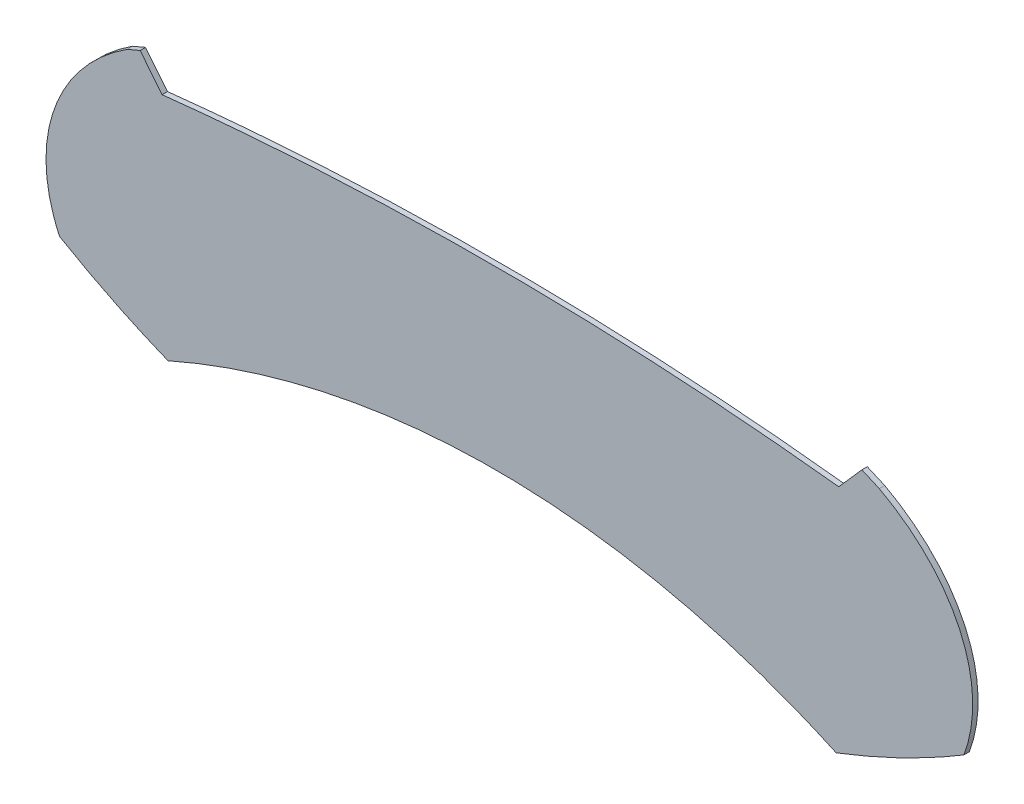
ISO-10303-21;
HEADER;
FILE_DESCRIPTION(('STEP AP214'),'2;1');
FILE_NAME('part.step','',(''),(''),'','','');
FILE_SCHEMA(('AUTOMOTIVE_DESIGN { 1 0 10303 214 1 1 1 1 }'));
ENDSEC;
DATA;
#1=APPLICATION_CONTEXT('core data for automotive mechanical design processes');
#2=APPLICATION_PROTOCOL_DEFINITION('international standard','automotive_design',2000,#1);
#3=PRODUCT_CONTEXT('',#1,'mechanical');
#4=PRODUCT('Part','Part','',(#3));
#5=PRODUCT_RELATED_PRODUCT_CATEGORY('part','',(#4));
#6=PRODUCT_DEFINITION_FORMATION('','',#4);
#7=PRODUCT_DEFINITION_CONTEXT('part definition',#1,'design');
#8=PRODUCT_DEFINITION('design','',#6,#7);
#9=PRODUCT_DEFINITION_SHAPE('','',#8);
#10=(LENGTH_UNIT() NAMED_UNIT(*) SI_UNIT(.MILLI.,.METRE.));
#11=(NAMED_UNIT(*) PLANE_ANGLE_UNIT() SI_UNIT($,.RADIAN.));
#12=(NAMED_UNIT(*) SI_UNIT($,.STERADIAN.) SOLID_ANGLE_UNIT());
#13=UNCERTAINTY_MEASURE_WITH_UNIT(LENGTH_MEASURE(1.E-05),#10,'distance_accuracy_value','');
#14=(GEOMETRIC_REPRESENTATION_CONTEXT(3) GLOBAL_UNCERTAINTY_ASSIGNED_CONTEXT((#13)) GLOBAL_UNIT_ASSIGNED_CONTEXT((#10,
#11,#12)) REPRESENTATION_CONTEXT('',''));
#15=CARTESIAN_POINT('',(0.,0.,0.));
#16=DIRECTION('',(0.,0.,1.));
#17=DIRECTION('',(1.,0.,0.));
#18=AXIS2_PLACEMENT_3D('',#15,#16,#17);
#19=CARTESIAN_POINT('',(67.0989134666407,30.7870693027646,0.1));
#20=CARTESIAN_POINT('',(60.8366785265383,31.4893738942949,0.1));
#21=CARTESIAN_POINT('',(54.5705838321318,30.8094593968933,0.1));
#22=(BOUNDED_CURVE() B_SPLINE_CURVE(2,(#19,#20,#21),.UNSPECIFIED.,.F.,
.F.) B_SPLINE_CURVE_WITH_KNOTS((3,3),(4.77600442953558,5.05009422888783),
.UNSPECIFIED.) CURVE() GEOMETRIC_REPRESENTATION_ITEM() RATIONAL_B_SPLINE_CURVE((1.,
0.990624035929916,1.)) REPRESENTATION_ITEM(''));
#23=DIRECTION('',(0.,0.,-1.));
#24=VECTOR('',#23,1.);
#25=SURFACE_OF_LINEAR_EXTRUSION('',#22,#24);
#26=CARTESIAN_POINT('',(67.0989134666407,30.7870693027646,0.));
#27=CARTESIAN_POINT('',(60.8366785265383,31.4893738942949,0.));
#28=CARTESIAN_POINT('',(54.5705838321318,30.8094593968933,0.));
#29=(BOUNDED_CURVE() B_SPLINE_CURVE(2,(#26,#27,#28),.UNSPECIFIED.,.F.,
.F.) B_SPLINE_CURVE_WITH_KNOTS((3,3),(4.77600442953558,5.05009422888783),
.UNSPECIFIED.) CURVE() GEOMETRIC_REPRESENTATION_ITEM() RATIONAL_B_SPLINE_CURVE((1.,
0.990624035929916,1.)) REPRESENTATION_ITEM(''));
#30=CARTESIAN_POINT('',(67.0989134666407,30.7870693027646,0.));
#31=VERTEX_POINT('',#30);
#32=CARTESIAN_POINT('',(54.5705838321318,30.8094593968933,0.));
#33=VERTEX_POINT('',#32);
#34=EDGE_CURVE('E268',#31,#33,#29,.T.);
#35=ORIENTED_EDGE('',*,*,#34,.T.);
#36=DIRECTION('',(0.,0.,-1.));
#37=VECTOR('',#36,1.);
#38=CARTESIAN_POINT('',(54.5705838321318,30.8094593968933,0.1));
#39=LINE('',#38,#37);
#40=CARTESIAN_POINT('',(54.5705838321318,30.8094593968933,0.1));
#41=VERTEX_POINT('',#40);
#42=EDGE_CURVE('E11',#41,#33,#39,.T.);
#43=ORIENTED_EDGE('',*,*,#42,.F.);
#44=CARTESIAN_POINT('',(67.0989134666407,30.7870693027646,0.1));
#45=VERTEX_POINT('',#44);
#46=EDGE_CURVE('E216',#45,#41,#22,.T.);
#47=ORIENTED_EDGE('',*,*,#46,.F.);
#48=DIRECTION('',(0.,0.,-1.));
#49=VECTOR('',#48,1.);
#50=CARTESIAN_POINT('',(67.0989134666407,30.7870693027646,0.1));
#51=LINE('',#50,#49);
#52=EDGE_CURVE('E138',#45,#31,#51,.T.);
#53=ORIENTED_EDGE('',*,*,#52,.T.);
#54=EDGE_LOOP('',(#35,#43,#47,#53));
#55=FACE_BOUND('',#54,.T.);
#56=ADVANCED_FACE('F33',(#55),#25,.F.);
#57=CARTESIAN_POINT('',(54.5705838321318,30.8094593968933,0.1));
#58=DIRECTION('',(-0.779683299889608,-0.62617405876741,0.));
#59=DIRECTION('',(0.62617405876741,-0.779683299889608,0.));
#60=AXIS2_PLACEMENT_3D('',#57,#58,#59);
#61=PLANE('',#60);
#62=CARTESIAN_POINT('',(54.5705838321318,30.8094593968933,0.));
#63=CARTESIAN_POINT('',(54.3675165126696,31.0623095357983,0.));
#64=CARTESIAN_POINT('',(54.1644491932074,31.3151596747032,0.));
#65=(BOUNDED_CURVE() B_SPLINE_CURVE(2,(#62,#63,#64),.UNSPECIFIED.,.F.,
.F.) B_SPLINE_CURVE_WITH_KNOTS((3,3),(5.05009422888783,6.05009422888783),
.UNSPECIFIED.) CURVE() GEOMETRIC_REPRESENTATION_ITEM() RATIONAL_B_SPLINE_CURVE((1.,1.,1.)) REPRESENTATION_ITEM(''));
#66=CARTESIAN_POINT('',(54.1644491932074,31.3151596747032,0.));
#67=VERTEX_POINT('',#66);
#68=EDGE_CURVE('E262',#33,#67,#65,.T.);
#69=ORIENTED_EDGE('',*,*,#68,.T.);
#70=DIRECTION('',(0.,0.,-1.));
#71=VECTOR('',#70,1.);
#72=CARTESIAN_POINT('',(54.1644491932074,31.3151596747032,0.1));
#73=LINE('',#72,#71);
#74=CARTESIAN_POINT('',(54.1644491932074,31.3151596747032,0.1));
#75=VERTEX_POINT('',#74);
#76=EDGE_CURVE('E42',#75,#67,#73,.T.);
#77=ORIENTED_EDGE('',*,*,#76,.F.);
#78=CARTESIAN_POINT('',(54.5705838321318,30.8094593968933,0.1));
#79=CARTESIAN_POINT('',(54.3675165126696,31.0623095357983,0.1));
#80=CARTESIAN_POINT('',(54.1644491932074,31.3151596747032,0.1));
#81=(BOUNDED_CURVE() B_SPLINE_CURVE(2,(#78,#79,#80),.UNSPECIFIED.,.F.,
.F.) B_SPLINE_CURVE_WITH_KNOTS((3,3),(5.05009422888783,6.05009422888783),
.UNSPECIFIED.) CURVE() GEOMETRIC_REPRESENTATION_ITEM() RATIONAL_B_SPLINE_CURVE((1.,1.,1.)) REPRESENTATION_ITEM(''));
#82=EDGE_CURVE('E99',#41,#75,#81,.T.);
#83=ORIENTED_EDGE('',*,*,#82,.F.);
#84=ORIENTED_EDGE('',*,*,#42,.T.);
#85=EDGE_LOOP('',(#69,#77,#83,#84));
#86=FACE_BOUND('',#85,.T.);
#87=ADVANCED_FACE('F204',(#86),#61,.F.);
#88=CARTESIAN_POINT('',(54.1644491932074,31.3151596747033,0.1));
#89=CARTESIAN_POINT('',(54.0438552768817,31.2653158805157,0.1));
#90=CARTESIAN_POINT('',(53.9244533851282,31.2136680771229,0.1));
#91=(BOUNDED_CURVE() B_SPLINE_CURVE(2,(#88,#89,#90),.UNSPECIFIED.,.F.,
.F.) B_SPLINE_CURVE_WITH_KNOTS((3,3),(0.,0.0187915377883803),
.UNSPECIFIED.) CURVE() GEOMETRIC_REPRESENTATION_ITEM() RATIONAL_B_SPLINE_CURVE((1.,
0.999955860088169,1.)) REPRESENTATION_ITEM(''));
#92=DIRECTION('',(0.,0.,-1.));
#93=VECTOR('',#92,1.);
#94=SURFACE_OF_LINEAR_EXTRUSION('',#91,#93);
#95=CARTESIAN_POINT('',(54.1644491932074,31.3151596747033,0.));
#96=CARTESIAN_POINT('',(54.0438552768817,31.2653158805157,0.));
#97=CARTESIAN_POINT('',(53.9244533851282,31.2136680771229,0.));
#98=(BOUNDED_CURVE() B_SPLINE_CURVE(2,(#95,#96,#97),.UNSPECIFIED.,.F.,
.F.) B_SPLINE_CURVE_WITH_KNOTS((3,3),(0.,0.0187915377883803),
.UNSPECIFIED.) CURVE() GEOMETRIC_REPRESENTATION_ITEM() RATIONAL_B_SPLINE_CURVE((1.,
0.999955860088169,1.)) REPRESENTATION_ITEM(''));
#99=CARTESIAN_POINT('',(53.9244533851282,31.2136680771229,0.));
#100=VERTEX_POINT('',#99);
#101=EDGE_CURVE('E257',#67,#100,#98,.T.);
#102=ORIENTED_EDGE('',*,*,#101,.T.);
#103=DIRECTION('',(0.,0.,-1.));
#104=VECTOR('',#103,1.);
#105=CARTESIAN_POINT('',(53.9244533851282,31.2136680771229,0.1));
#106=LINE('',#105,#104);
#107=CARTESIAN_POINT('',(53.9244533851282,31.2136680771229,0.1));
#108=VERTEX_POINT('',#107);
#109=EDGE_CURVE('E251',#108,#100,#106,.T.);
#110=ORIENTED_EDGE('',*,*,#109,.F.);
#111=EDGE_CURVE('E206',#75,#108,#91,.T.);
#112=ORIENTED_EDGE('',*,*,#111,.F.);
#113=ORIENTED_EDGE('',*,*,#76,.T.);
#114=EDGE_LOOP('',(#102,#110,#112,#113));
#115=FACE_BOUND('',#114,.T.);
#116=ADVANCED_FACE('F201',(#115),#94,.F.);
#117=CARTESIAN_POINT('',(53.9244533851282,31.2136680771229,0.1));
#118=CARTESIAN_POINT('',(51.6668754829006,29.7616501644239,0.1));
#119=CARTESIAN_POINT('',(52.6705171553145,27.5878177650123,0.1));
#120=(BOUNDED_CURVE() B_SPLINE_CURVE(2,(#117,#118,#119),.UNSPECIFIED.,.F.,
.F.) B_SPLINE_CURVE_WITH_KNOTS((3,3),(0.0187915377883803,1.26624299550098),
.UNSPECIFIED.) CURVE() GEOMETRIC_REPRESENTATION_ITEM() RATIONAL_B_SPLINE_CURVE((1.,
0.811708033467145,1.)) REPRESENTATION_ITEM(''));
#121=DIRECTION('',(0.,0.,-1.));
#122=VECTOR('',#121,1.);
#123=SURFACE_OF_LINEAR_EXTRUSION('',#120,#122);
#124=CARTESIAN_POINT('',(53.9244533851282,31.2136680771229,0.));
#125=CARTESIAN_POINT('',(51.6668754829006,29.7616501644239,0.));
#126=CARTESIAN_POINT('',(52.6705171553145,27.5878177650123,0.));
#127=(BOUNDED_CURVE() B_SPLINE_CURVE(2,(#124,#125,#126),.UNSPECIFIED.,.F.,
.F.) B_SPLINE_CURVE_WITH_KNOTS((3,3),(0.0187915377883803,1.26624299550098),
.UNSPECIFIED.) CURVE() GEOMETRIC_REPRESENTATION_ITEM() RATIONAL_B_SPLINE_CURVE((1.,
0.811708033467145,1.)) REPRESENTATION_ITEM(''));
#128=CARTESIAN_POINT('',(52.6705171553145,27.5878177650123,0.));
#129=VERTEX_POINT('',#128);
#130=EDGE_CURVE('E264',#100,#129,#127,.T.);
#131=ORIENTED_EDGE('',*,*,#130,.T.);
#132=DIRECTION('',(0.,0.,-1.));
#133=VECTOR('',#132,1.);
#134=CARTESIAN_POINT('',(52.6705171553145,27.5878177650123,0.1));
#135=LINE('',#134,#133);
#136=CARTESIAN_POINT('',(52.6705171553145,27.5878177650123,0.1));
#137=VERTEX_POINT('',#136);
#138=EDGE_CURVE('E248',#137,#129,#135,.T.);
#139=ORIENTED_EDGE('',*,*,#138,.F.);
#140=EDGE_CURVE('E186',#108,#137,#120,.T.);
#141=ORIENTED_EDGE('',*,*,#140,.F.);
#142=ORIENTED_EDGE('',*,*,#109,.T.);
#143=EDGE_LOOP('',(#131,#139,#141,#142));
#144=FACE_BOUND('',#143,.T.);
#145=ADVANCED_FACE('F197',(#144),#123,.F.);
#146=CARTESIAN_POINT('',(52.6705171553145,27.5878177650123,0.1));
#147=CARTESIAN_POINT('',(53.6230494195417,27.0250289886642,0.1));
#148=CARTESIAN_POINT('',(54.6801318608769,26.5981055296968,0.1));
#149=(BOUNDED_CURVE() B_SPLINE_CURVE(2,(#146,#147,#148),.UNSPECIFIED.,.F.,
.F.) B_SPLINE_CURVE_WITH_KNOTS((3,3),(1.26624299550098,1.43486145262142),
.UNSPECIFIED.) CURVE() GEOMETRIC_REPRESENTATION_ITEM() RATIONAL_B_SPLINE_CURVE((1.,
0.996448081670989,1.)) REPRESENTATION_ITEM(''));
#150=DIRECTION('',(0.,0.,-1.));
#151=VECTOR('',#150,1.);
#152=SURFACE_OF_LINEAR_EXTRUSION('',#149,#151);
#153=CARTESIAN_POINT('',(52.6705171553145,27.5878177650123,0.));
#154=CARTESIAN_POINT('',(53.6230494195417,27.0250289886642,0.));
#155=CARTESIAN_POINT('',(54.6801318608769,26.5981055296968,0.));
#156=(BOUNDED_CURVE() B_SPLINE_CURVE(2,(#153,#154,#155),.UNSPECIFIED.,.F.,
.F.) B_SPLINE_CURVE_WITH_KNOTS((3,3),(1.26624299550098,1.43486145262142),
.UNSPECIFIED.) CURVE() GEOMETRIC_REPRESENTATION_ITEM() RATIONAL_B_SPLINE_CURVE((1.,
0.996448081670989,1.)) REPRESENTATION_ITEM(''));
#157=CARTESIAN_POINT('',(54.6801318608769,26.5981055296968,0.));
#158=VERTEX_POINT('',#157);
#159=EDGE_CURVE('E266',#129,#158,#156,.T.);
#160=ORIENTED_EDGE('',*,*,#159,.T.);
#161=DIRECTION('',(0.,0.,-1.));
#162=VECTOR('',#161,1.);
#163=CARTESIAN_POINT('',(54.6801318608769,26.5981055296968,0.1));
#164=LINE('',#163,#162);
#165=CARTESIAN_POINT('',(54.6801318608769,26.5981055296968,0.1));
#166=VERTEX_POINT('',#165);
#167=EDGE_CURVE('E245',#166,#158,#164,.T.);
#168=ORIENTED_EDGE('',*,*,#167,.F.);
#169=EDGE_CURVE('E178',#137,#166,#149,.T.);
#170=ORIENTED_EDGE('',*,*,#169,.F.);
#171=ORIENTED_EDGE('',*,*,#138,.T.);
#172=EDGE_LOOP('',(#160,#168,#170,#171));
#173=FACE_BOUND('',#172,.T.);
#174=ADVANCED_FACE('F194',(#173),#152,.F.);
#175=CARTESIAN_POINT('',(60.7534915437261,12.8735180254221,0.1));
#176=DIRECTION('',(0.,0.,-1.));
#177=DIRECTION('',(-1.,0.,0.));
#178=AXIS2_PLACEMENT_3D('',#175,#176,#177);
#179=CYLINDRICAL_SURFACE('',#178,15.0083310197971);
#180=CARTESIAN_POINT('',(54.6801318608769,26.5981055296968,0.));
#181=CARTESIAN_POINT('',(60.8887719964031,29.3455327053901,0.));
#182=CARTESIAN_POINT('',(67.0514498602835,26.4965030523081,0.));
#183=(BOUNDED_CURVE() B_SPLINE_CURVE(2,(#180,#181,#182),.UNSPECIFIED.,.F.,
.F.) B_SPLINE_CURVE_WITH_KNOTS((3,3),(1.43486145262142,2.28451346017373),
.UNSPECIFIED.) CURVE() GEOMETRIC_REPRESENTATION_ITEM() RATIONAL_B_SPLINE_CURVE((1.,
0.911110461422003,1.)) REPRESENTATION_ITEM(''));
#184=CARTESIAN_POINT('',(67.0514498602835,26.4965030523081,0.));
#185=VERTEX_POINT('',#184);
#186=EDGE_CURVE('E286',#158,#185,#183,.T.);
#187=ORIENTED_EDGE('',*,*,#186,.T.);
#188=DIRECTION('',(0.,0.,-1.));
#189=VECTOR('',#188,1.);
#190=CARTESIAN_POINT('',(67.0514498602835,26.4965030523081,0.1));
#191=LINE('',#190,#189);
#192=CARTESIAN_POINT('',(67.0514498602835,26.4965030523081,0.1));
#193=VERTEX_POINT('',#192);
#194=EDGE_CURVE('E242',#193,#185,#191,.T.);
#195=ORIENTED_EDGE('',*,*,#194,.F.);
#196=CARTESIAN_POINT('',(54.6801318608769,26.5981055296968,0.1));
#197=CARTESIAN_POINT('',(60.8887719964031,29.3455327053901,0.1));
#198=CARTESIAN_POINT('',(67.0514498602835,26.4965030523081,0.1));
#199=(BOUNDED_CURVE() B_SPLINE_CURVE(2,(#196,#197,#198),.UNSPECIFIED.,.F.,
.F.) B_SPLINE_CURVE_WITH_KNOTS((3,3),(1.43486145262142,2.28451346017373),
.UNSPECIFIED.) CURVE() GEOMETRIC_REPRESENTATION_ITEM() RATIONAL_B_SPLINE_CURVE((1.,
0.911110461422003,1.)) REPRESENTATION_ITEM(''));
#200=EDGE_CURVE('E171',#166,#193,#199,.T.);
#201=ORIENTED_EDGE('',*,*,#200,.F.);
#202=ORIENTED_EDGE('',*,*,#167,.T.);
#203=EDGE_LOOP('',(#187,#195,#201,#202));
#204=FACE_BOUND('',#203,.T.);
#205=ADVANCED_FACE('F164',(#204),#179,.F.);
#206=CARTESIAN_POINT('',(67.0514498602835,26.4965030523081,0.1));
#207=CARTESIAN_POINT('',(68.305506812292,26.9773927923128,0.1));
#208=CARTESIAN_POINT('',(69.416942943704,27.6461011169449,0.1));
#209=(BOUNDED_CURVE() B_SPLINE_CURVE(2,(#206,#207,#208),.UNSPECIFIED.,.F.,
.F.) B_SPLINE_CURVE_WITH_KNOTS((3,3),(2.28451346017373,2.48236386752286),
.UNSPECIFIED.) CURVE() GEOMETRIC_REPRESENTATION_ITEM() RATIONAL_B_SPLINE_CURVE((1.,
0.995110891138781,1.)) REPRESENTATION_ITEM(''));
#210=DIRECTION('',(0.,0.,-1.));
#211=VECTOR('',#210,1.);
#212=SURFACE_OF_LINEAR_EXTRUSION('',#209,#211);
#213=CARTESIAN_POINT('',(67.0514498602835,26.4965030523081,0.));
#214=CARTESIAN_POINT('',(68.305506812292,26.9773927923128,0.));
#215=CARTESIAN_POINT('',(69.416942943704,27.6461011169449,0.));
#216=(BOUNDED_CURVE() B_SPLINE_CURVE(2,(#213,#214,#215),.UNSPECIFIED.,.F.,
.F.) B_SPLINE_CURVE_WITH_KNOTS((3,3),(2.28451346017373,2.48236386752286),
.UNSPECIFIED.) CURVE() GEOMETRIC_REPRESENTATION_ITEM() RATIONAL_B_SPLINE_CURVE((1.,
0.995110891138781,1.)) REPRESENTATION_ITEM(''));
#217=CARTESIAN_POINT('',(69.416942943704,27.6461011169449,0.));
#218=VERTEX_POINT('',#217);
#219=EDGE_CURVE('E293',#185,#218,#216,.T.);
#220=ORIENTED_EDGE('',*,*,#219,.T.);
#221=DIRECTION('',(0.,0.,-1.));
#222=VECTOR('',#221,1.);
#223=CARTESIAN_POINT('',(69.416942943704,27.6461011169449,0.1));
#224=LINE('',#223,#222);
#225=CARTESIAN_POINT('',(69.416942943704,27.6461011169449,0.1));
#226=VERTEX_POINT('',#225);
#227=EDGE_CURVE('E133',#226,#218,#224,.T.);
#228=ORIENTED_EDGE('',*,*,#227,.F.);
#229=EDGE_CURVE('E124',#193,#226,#209,.T.);
#230=ORIENTED_EDGE('',*,*,#229,.F.);
#231=ORIENTED_EDGE('',*,*,#194,.T.);
#232=EDGE_LOOP('',(#220,#228,#230,#231));
#233=FACE_BOUND('',#232,.T.);
#234=ADVANCED_FACE('F161',(#233),#212,.F.);
#235=CARTESIAN_POINT('',(69.416942943704,27.6461011169449,0.1));
#236=CARTESIAN_POINT('',(70.2361200650426,29.8505666211852,0.1));
#237=CARTESIAN_POINT('',(67.8497592052182,31.1329555174223,0.1));
#238=(BOUNDED_CURVE() B_SPLINE_CURVE(2,(#235,#236,#237),.UNSPECIFIED.,.F.,
.F.) B_SPLINE_CURVE_WITH_KNOTS((3,3),(2.48236386752286,3.7506203292269),
.UNSPECIFIED.) CURVE() GEOMETRIC_REPRESENTATION_ITEM() RATIONAL_B_SPLINE_CURVE((1.,
0.805588504344498,1.)) REPRESENTATION_ITEM(''));
#239=DIRECTION('',(0.,0.,-1.));
#240=VECTOR('',#239,1.);
#241=SURFACE_OF_LINEAR_EXTRUSION('',#238,#240);
#242=CARTESIAN_POINT('',(69.416942943704,27.6461011169449,0.));
#243=CARTESIAN_POINT('',(70.2361200650426,29.8505666211852,0.));
#244=CARTESIAN_POINT('',(67.8497592052182,31.1329555174223,0.));
#245=(BOUNDED_CURVE() B_SPLINE_CURVE(2,(#242,#243,#244),.UNSPECIFIED.,.F.,
.F.) B_SPLINE_CURVE_WITH_KNOTS((3,3),(2.48236386752286,3.7506203292269),
.UNSPECIFIED.) CURVE() GEOMETRIC_REPRESENTATION_ITEM() RATIONAL_B_SPLINE_CURVE((1.,
0.805588504344498,1.)) REPRESENTATION_ITEM(''));
#246=CARTESIAN_POINT('',(67.8497592052182,31.1329555174223,0.));
#247=VERTEX_POINT('',#246);
#248=EDGE_CURVE('E132',#218,#247,#245,.T.);
#249=ORIENTED_EDGE('',*,*,#248,.T.);
#250=DIRECTION('',(0.,0.,-1.));
#251=VECTOR('',#250,1.);
#252=CARTESIAN_POINT('',(67.8497592052182,31.1329555174223,0.1));
#253=LINE('',#252,#251);
#254=CARTESIAN_POINT('',(67.8497592052182,31.1329555174223,0.1));
#255=VERTEX_POINT('',#254);
#256=EDGE_CURVE('E129',#255,#247,#253,.T.);
#257=ORIENTED_EDGE('',*,*,#256,.F.);
#258=EDGE_CURVE('E118',#226,#255,#238,.T.);
#259=ORIENTED_EDGE('',*,*,#258,.F.);
#260=ORIENTED_EDGE('',*,*,#227,.T.);
#261=EDGE_LOOP('',(#249,#257,#259,#260));
#262=FACE_BOUND('',#261,.T.);
#263=ADVANCED_FACE('F130',(#262),#241,.F.);
#264=CARTESIAN_POINT('',(67.8497592052182,31.1329555174223,0.1));
#265=CARTESIAN_POINT('',(67.6897446734995,31.2045867582303,0.1));
#266=CARTESIAN_POINT('',(67.5275090677261,31.272945811407,0.1));
#267=(BOUNDED_CURVE() B_SPLINE_CURVE(2,(#264,#265,#266),.UNSPECIFIED.,.F.,
.F.) B_SPLINE_CURVE_WITH_KNOTS((3,3),(3.7506203292269,3.77600442953558),
.UNSPECIFIED.) CURVE() GEOMETRIC_REPRESENTATION_ITEM() RATIONAL_B_SPLINE_CURVE((1.,
0.999919457012658,1.)) REPRESENTATION_ITEM(''));
#268=DIRECTION('',(0.,0.,-1.));
#269=VECTOR('',#268,1.);
#270=SURFACE_OF_LINEAR_EXTRUSION('',#267,#269);
#271=CARTESIAN_POINT('',(67.8497592052182,31.1329555174223,0.));
#272=CARTESIAN_POINT('',(67.6897446734995,31.2045867582303,0.));
#273=CARTESIAN_POINT('',(67.5275090677261,31.272945811407,0.));
#274=(BOUNDED_CURVE() B_SPLINE_CURVE(2,(#271,#272,#273),.UNSPECIFIED.,.F.,
.F.) B_SPLINE_CURVE_WITH_KNOTS((3,3),(3.7506203292269,3.77600442953558),
.UNSPECIFIED.) CURVE() GEOMETRIC_REPRESENTATION_ITEM() RATIONAL_B_SPLINE_CURVE((1.,
0.999919457012658,1.)) REPRESENTATION_ITEM(''));
#275=CARTESIAN_POINT('',(67.5275090677261,31.272945811407,0.));
#276=VERTEX_POINT('',#275);
#277=EDGE_CURVE('E85',#247,#276,#274,.T.);
#278=ORIENTED_EDGE('',*,*,#277,.T.);
#279=DIRECTION('',(0.,0.,-1.));
#280=VECTOR('',#279,1.);
#281=CARTESIAN_POINT('',(67.5275090677261,31.272945811407,0.1));
#282=LINE('',#281,#280);
#283=CARTESIAN_POINT('',(67.5275090677261,31.272945811407,0.1));
#284=VERTEX_POINT('',#283);
#285=EDGE_CURVE('E134',#284,#276,#282,.T.);
#286=ORIENTED_EDGE('',*,*,#285,.F.);
#287=EDGE_CURVE('E122',#255,#284,#267,.T.);
#288=ORIENTED_EDGE('',*,*,#287,.F.);
#289=ORIENTED_EDGE('',*,*,#256,.T.);
#290=EDGE_LOOP('',(#278,#286,#288,#289));
#291=FACE_BOUND('',#290,.T.);
#292=ADVANCED_FACE('F136',(#291),#270,.F.);
#293=CARTESIAN_POINT('',(67.5275090677261,31.272945811407,0.1));
#294=DIRECTION('',(0.749928942685445,-0.661518390464461,0.));
#295=DIRECTION('',(0.661518390464461,0.749928942685445,0.));
#296=AXIS2_PLACEMENT_3D('',#293,#294,#295);
#297=PLANE('',#296);
#298=CARTESIAN_POINT('',(67.5275090677261,31.272945811407,0.));
#299=CARTESIAN_POINT('',(67.3132112671834,31.0300075570858,0.));
#300=CARTESIAN_POINT('',(67.0989134666407,30.7870693027646,0.));
#301=(BOUNDED_CURVE() B_SPLINE_CURVE(2,(#298,#299,#300),.UNSPECIFIED.,.F.,
.F.) B_SPLINE_CURVE_WITH_KNOTS((3,3),(3.77600442953558,4.77600442953558),
.UNSPECIFIED.) CURVE() GEOMETRIC_REPRESENTATION_ITEM() RATIONAL_B_SPLINE_CURVE((1.,1.,1.)) REPRESENTATION_ITEM(''));
#302=EDGE_CURVE('E91',#276,#31,#301,.T.);
#303=ORIENTED_EDGE('',*,*,#302,.T.);
#304=ORIENTED_EDGE('',*,*,#52,.F.);
#305=CARTESIAN_POINT('',(67.5275090677261,31.272945811407,0.1));
#306=CARTESIAN_POINT('',(67.3132112671834,31.0300075570858,0.1));
#307=CARTESIAN_POINT('',(67.0989134666407,30.7870693027646,0.1));
#308=(BOUNDED_CURVE() B_SPLINE_CURVE(2,(#305,#306,#307),.UNSPECIFIED.,.F.,
.F.) B_SPLINE_CURVE_WITH_KNOTS((3,3),(3.77600442953558,4.77600442953558),
.UNSPECIFIED.) CURVE() GEOMETRIC_REPRESENTATION_ITEM() RATIONAL_B_SPLINE_CURVE((1.,1.,1.)) REPRESENTATION_ITEM(''));
#309=EDGE_CURVE('E50',#284,#45,#308,.T.);
#310=ORIENTED_EDGE('',*,*,#309,.F.);
#311=ORIENTED_EDGE('',*,*,#285,.T.);
#312=EDGE_LOOP('',(#303,#304,#310,#311));
#313=FACE_BOUND('',#312,.T.);
#314=ADVANCED_FACE('F157',(#313),#297,.F.);
#315=CARTESIAN_POINT('',(60.835709043041,31.14219153741,0.1));
#316=DIRECTION('',(0.,0.,-1.));
#317=DIRECTION('',(-1.,0.,0.));
#318=AXIS2_PLACEMENT_3D('',#315,#316,#317);
#319=PLANE('',#318);
#320=ORIENTED_EDGE('',*,*,#46,.T.);
#321=ORIENTED_EDGE('',*,*,#82,.T.);
#322=ORIENTED_EDGE('',*,*,#111,.T.);
#323=ORIENTED_EDGE('',*,*,#140,.T.);
#324=ORIENTED_EDGE('',*,*,#169,.T.);
#325=ORIENTED_EDGE('',*,*,#200,.T.);
#326=ORIENTED_EDGE('',*,*,#229,.T.);
#327=ORIENTED_EDGE('',*,*,#258,.T.);
#328=ORIENTED_EDGE('',*,*,#287,.T.);
#329=ORIENTED_EDGE('',*,*,#309,.T.);
#330=EDGE_LOOP('',(#320,#321,#322,#323,#324,#325,#326,#327,#328,#329));
#331=FACE_BOUND('',#330,.T.);
#332=ADVANCED_FACE('F120',(#331),#319,.F.);
#333=CARTESIAN_POINT('',(60.835709043041,31.14219153741,0.));
#334=DIRECTION('',(0.,0.,-1.));
#335=DIRECTION('',(-1.,0.,0.));
#336=AXIS2_PLACEMENT_3D('',#333,#334,#335);
#337=PLANE('',#336);
#338=ORIENTED_EDGE('',*,*,#34,.F.);
#339=ORIENTED_EDGE('',*,*,#302,.F.);
#340=ORIENTED_EDGE('',*,*,#277,.F.);
#341=ORIENTED_EDGE('',*,*,#248,.F.);
#342=ORIENTED_EDGE('',*,*,#219,.F.);
#343=ORIENTED_EDGE('',*,*,#186,.F.);
#344=ORIENTED_EDGE('',*,*,#159,.F.);
#345=ORIENTED_EDGE('',*,*,#130,.F.);
#346=ORIENTED_EDGE('',*,*,#101,.F.);
#347=ORIENTED_EDGE('',*,*,#68,.F.);
#348=EDGE_LOOP('',(#338,#339,#340,#341,#342,#343,#344,#345,#346,#347));
#349=FACE_BOUND('',#348,.T.);
#350=ADVANCED_FACE('F261',(#349),#337,.T.);
#351=CLOSED_SHELL('',(#56,#87,#116,#145,#174,#205,#234,#263,#292,#314,#332,#350));
#352=MANIFOLD_SOLID_BREP('B2',#351);
#353=ADVANCED_BREP_SHAPE_REPRESENTATION('',(#18,#352),#14);
#354=SHAPE_DEFINITION_REPRESENTATION(#9,#353);
ENDSEC;
END-ISO-10303-21;
